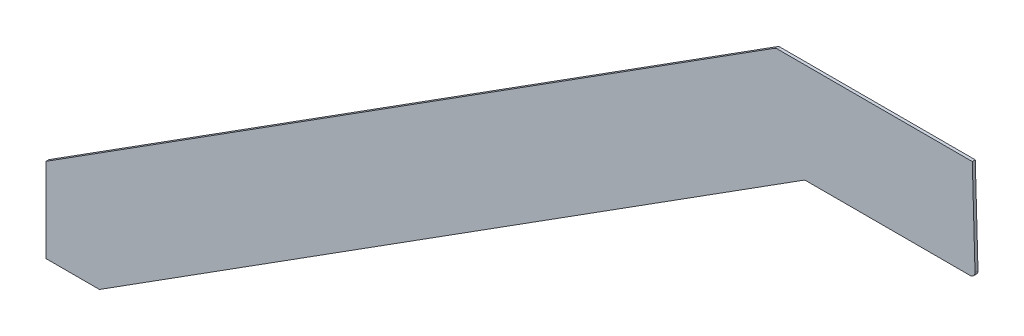
ISO-10303-21;
HEADER;
FILE_DESCRIPTION(('STEP AP214'),'2;1');
FILE_NAME('part.step','',(''),(''),'','','');
FILE_SCHEMA(('AUTOMOTIVE_DESIGN { 1 0 10303 214 1 1 1 1 }'));
ENDSEC;
DATA;
#1=APPLICATION_CONTEXT('core data for automotive mechanical design processes');
#2=APPLICATION_PROTOCOL_DEFINITION('international standard','automotive_design',2000,#1);
#3=PRODUCT_CONTEXT('',#1,'mechanical');
#4=PRODUCT('Part','Part','',(#3));
#5=PRODUCT_RELATED_PRODUCT_CATEGORY('part','',(#4));
#6=PRODUCT_DEFINITION_FORMATION('','',#4);
#7=PRODUCT_DEFINITION_CONTEXT('part definition',#1,'design');
#8=PRODUCT_DEFINITION('design','',#6,#7);
#9=PRODUCT_DEFINITION_SHAPE('','',#8);
#10=(LENGTH_UNIT() NAMED_UNIT(*) SI_UNIT(.MILLI.,.METRE.));
#11=(NAMED_UNIT(*) PLANE_ANGLE_UNIT() SI_UNIT($,.RADIAN.));
#12=(NAMED_UNIT(*) SI_UNIT($,.STERADIAN.) SOLID_ANGLE_UNIT());
#13=UNCERTAINTY_MEASURE_WITH_UNIT(LENGTH_MEASURE(1.E-05),#10,'distance_accuracy_value','');
#14=(GEOMETRIC_REPRESENTATION_CONTEXT(3) GLOBAL_UNCERTAINTY_ASSIGNED_CONTEXT((#13)) GLOBAL_UNIT_ASSIGNED_CONTEXT((#10,
#11,#12)) REPRESENTATION_CONTEXT('',''));
#15=CARTESIAN_POINT('',(0.,0.,0.));
#16=DIRECTION('',(0.,0.,1.));
#17=DIRECTION('',(1.,0.,0.));
#18=AXIS2_PLACEMENT_3D('',#15,#16,#17);
#19=CARTESIAN_POINT('',(-296.68469966244,19.9999999999998,6.));
#20=DIRECTION('',(0.,0.,-1.));
#21=DIRECTION('',(-1.,0.,0.));
#22=AXIS2_PLACEMENT_3D('',#19,#20,#21);
#23=CYLINDRICAL_SURFACE('',#22,10.0000000000001);
#24=CARTESIAN_POINT('',(-296.68469966244,19.9999999999998,0.));
#25=DIRECTION('',(0.,0.,1.));
#26=DIRECTION('',(1.,0.,0.));
#27=AXIS2_PLACEMENT_3D('',#24,#25,#26);
#28=CIRCLE('',#27,10.0000000000001);
#29=CARTESIAN_POINT('',(-296.68469966244,29.9999999999998,0.));
#30=VERTEX_POINT('',#29);
#31=CARTESIAN_POINT('',(-302.04149617051,28.4442128804958,0.));
#32=VERTEX_POINT('',#31);
#33=EDGE_CURVE('E147',#30,#32,#28,.T.);
#34=ORIENTED_EDGE('',*,*,#33,.T.);
#35=DIRECTION('',(0.,0.,-1.));
#36=VECTOR('',#35,1.);
#37=CARTESIAN_POINT('',(-302.04149617051,28.4442128804958,6.));
#38=LINE('',#37,#36);
#39=CARTESIAN_POINT('',(-302.04149617051,28.4442128804958,6.));
#40=VERTEX_POINT('',#39);
#41=EDGE_CURVE('E11',#40,#32,#38,.T.);
#42=ORIENTED_EDGE('',*,*,#41,.F.);
#43=CARTESIAN_POINT('',(-296.68469966244,19.9999999999998,6.));
#44=DIRECTION('',(0.,0.,1.));
#45=DIRECTION('',(1.,0.,0.));
#46=AXIS2_PLACEMENT_3D('',#43,#44,#45);
#47=CIRCLE('',#46,10.0000000000001);
#48=CARTESIAN_POINT('',(-296.68469966244,29.9999999999998,6.));
#49=VERTEX_POINT('',#48);
#50=EDGE_CURVE('E165',#49,#40,#47,.T.);
#51=ORIENTED_EDGE('',*,*,#50,.F.);
#52=DIRECTION('',(0.,0.,-1.));
#53=VECTOR('',#52,1.);
#54=CARTESIAN_POINT('',(-296.68469966244,29.9999999999998,6.));
#55=LINE('',#54,#53);
#56=EDGE_CURVE('E143',#49,#30,#55,.T.);
#57=ORIENTED_EDGE('',*,*,#56,.T.);
#58=EDGE_LOOP('',(#34,#42,#51,#57));
#59=FACE_BOUND('',#58,.T.);
#60=ADVANCED_FACE('F39',(#59),#23,.T.);
#61=CARTESIAN_POINT('',(-1762.45302019176,-898.004168151072,6.));
#62=DIRECTION('',(0.535679650806948,-0.8444212880496,0.));
#63=DIRECTION('',(0.8444212880496,0.535679650806948,0.));
#64=AXIS2_PLACEMENT_3D('',#61,#62,#63);
#65=PLANE('',#64);
#66=DIRECTION('',(-0.8444212880496,-0.535679650806948,0.));
#67=VECTOR('',#66,1.);
#68=CARTESIAN_POINT('',(-1762.45302019176,-898.004168151072,0.));
#69=LINE('',#68,#67);
#70=CARTESIAN_POINT('',(-1762.45302019176,-898.004168151072,0.));
#71=VERTEX_POINT('',#70);
#72=EDGE_CURVE('E150',#32,#71,#69,.T.);
#73=ORIENTED_EDGE('',*,*,#72,.T.);
#74=DIRECTION('',(0.,0.,-1.));
#75=VECTOR('',#74,1.);
#76=CARTESIAN_POINT('',(-1762.45302019176,-898.004168151072,6.));
#77=LINE('',#76,#75);
#78=CARTESIAN_POINT('',(-1762.45302019176,-898.004168151072,6.));
#79=VERTEX_POINT('',#78);
#80=EDGE_CURVE('E47',#79,#71,#77,.T.);
#81=ORIENTED_EDGE('',*,*,#80,.F.);
#82=DIRECTION('',(-0.8444212880496,-0.535679650806948,0.));
#83=VECTOR('',#82,1.);
#84=CARTESIAN_POINT('',(-1762.45302019176,-898.004168151072,6.));
#85=LINE('',#84,#83);
#86=EDGE_CURVE('E104',#40,#79,#85,.T.);
#87=ORIENTED_EDGE('',*,*,#86,.F.);
#88=ORIENTED_EDGE('',*,*,#41,.T.);
#89=EDGE_LOOP('',(#73,#81,#87,#88));
#90=FACE_BOUND('',#89,.T.);
#91=ADVANCED_FACE('F214',(#90),#65,.F.);
#92=CARTESIAN_POINT('',(-1762.45302019176,-898.004168151072,6.));
#93=DIRECTION('',(1.,0.,0.));
#94=DIRECTION('',(0.,0.,-1.));
#95=AXIS2_PLACEMENT_3D('',#92,#93,#94);
#96=PLANE('',#95);
#97=DIRECTION('',(0.,-1.,0.));
#98=VECTOR('',#97,1.);
#99=CARTESIAN_POINT('',(-1762.45302019176,-898.004168151072,0.));
#100=LINE('',#99,#98);
#101=CARTESIAN_POINT('',(-1762.45302019176,-1066.88842576099,0.));
#102=VERTEX_POINT('',#101);
#103=EDGE_CURVE('E152',#71,#102,#100,.T.);
#104=ORIENTED_EDGE('',*,*,#103,.T.);
#105=DIRECTION('',(0.,0.,-1.));
#106=VECTOR('',#105,1.);
#107=CARTESIAN_POINT('',(-1762.45302019176,-1066.88842576099,6.));
#108=LINE('',#107,#106);
#109=CARTESIAN_POINT('',(-1762.45302019176,-1066.88842576099,6.));
#110=VERTEX_POINT('',#109);
#111=EDGE_CURVE('E178',#110,#102,#108,.T.);
#112=ORIENTED_EDGE('',*,*,#111,.F.);
#113=DIRECTION('',(0.,-1.,0.));
#114=VECTOR('',#113,1.);
#115=CARTESIAN_POINT('',(-1762.45302019176,-898.004168151072,6.));
#116=LINE('',#115,#114);
#117=EDGE_CURVE('E186',#79,#110,#116,.T.);
#118=ORIENTED_EDGE('',*,*,#117,.F.);
#119=ORIENTED_EDGE('',*,*,#80,.T.);
#120=EDGE_LOOP('',(#104,#112,#118,#119));
#121=FACE_BOUND('',#120,.T.);
#122=ADVANCED_FACE('F184',(#121),#96,.F.);
#123=CARTESIAN_POINT('',(-1762.45302019176,-1066.88842576099,6.));
#124=DIRECTION('',(0.,1.,0.));
#125=DIRECTION('',(0.,0.,1.));
#126=AXIS2_PLACEMENT_3D('',#123,#124,#125);
#127=PLANE('',#126);
#128=DIRECTION('',(1.,0.,0.));
#129=VECTOR('',#128,1.);
#130=CARTESIAN_POINT('',(-1762.45302019176,-1066.88842576099,0.));
#131=LINE('',#130,#129);
#132=CARTESIAN_POINT('',(-1655.31709003037,-1066.88842576099,0.));
#133=VERTEX_POINT('',#132);
#134=EDGE_CURVE('E154',#102,#133,#131,.T.);
#135=ORIENTED_EDGE('',*,*,#134,.T.);
#136=DIRECTION('',(0.,0.,-1.));
#137=VECTOR('',#136,1.);
#138=CARTESIAN_POINT('',(-1655.31709003037,-1066.88842576099,6.));
#139=LINE('',#138,#137);
#140=CARTESIAN_POINT('',(-1655.31709003037,-1066.88842576099,6.));
#141=VERTEX_POINT('',#140);
#142=EDGE_CURVE('E175',#141,#133,#139,.T.);
#143=ORIENTED_EDGE('',*,*,#142,.F.);
#144=DIRECTION('',(1.,0.,0.));
#145=VECTOR('',#144,1.);
#146=CARTESIAN_POINT('',(-1762.45302019176,-1066.88842576099,6.));
#147=LINE('',#146,#145);
#148=EDGE_CURVE('E204',#110,#141,#147,.T.);
#149=ORIENTED_EDGE('',*,*,#148,.F.);
#150=ORIENTED_EDGE('',*,*,#111,.T.);
#151=EDGE_LOOP('',(#135,#143,#149,#150));
#152=FACE_BOUND('',#151,.T.);
#153=ADVANCED_FACE('F195',(#152),#127,.F.);
#154=CARTESIAN_POINT('',(-1655.31709003037,-1066.88842576099,6.));
#155=DIRECTION('',(-0.535679650806948,0.8444212880496,0.));
#156=DIRECTION('',(-0.8444212880496,-0.535679650806948,0.));
#157=AXIS2_PLACEMENT_3D('',#154,#155,#156);
#158=PLANE('',#157);
#159=DIRECTION('',(0.8444212880496,0.535679650806948,0.));
#160=VECTOR('',#159,1.);
#161=CARTESIAN_POINT('',(-1655.31709003037,-1066.88842576099,0.));
#162=LINE('',#161,#160);
#163=CARTESIAN_POINT('',(-243.955021645657,-171.555787119504,0.));
#164=VERTEX_POINT('',#163);
#165=EDGE_CURVE('E156',#133,#164,#162,.T.);
#166=ORIENTED_EDGE('',*,*,#165,.T.);
#167=DIRECTION('',(0.,0.,-1.));
#168=VECTOR('',#167,1.);
#169=CARTESIAN_POINT('',(-243.955021645657,-171.555787119504,6.));
#170=LINE('',#169,#168);
#171=CARTESIAN_POINT('',(-243.955021645657,-171.555787119504,6.));
#172=VERTEX_POINT('',#171);
#173=EDGE_CURVE('E172',#172,#164,#170,.T.);
#174=ORIENTED_EDGE('',*,*,#173,.F.);
#175=DIRECTION('',(0.8444212880496,0.535679650806948,0.));
#176=VECTOR('',#175,1.);
#177=CARTESIAN_POINT('',(-1655.31709003037,-1066.88842576099,6.));
#178=LINE('',#177,#176);
#179=EDGE_CURVE('E201',#141,#172,#178,.T.);
#180=ORIENTED_EDGE('',*,*,#179,.F.);
#181=ORIENTED_EDGE('',*,*,#142,.T.);
#182=EDGE_LOOP('',(#166,#174,#180,#181));
#183=FACE_BOUND('',#182,.T.);
#184=ADVANCED_FACE('F199',(#183),#158,.F.);
#185=CARTESIAN_POINT('',(-238.598225137587,-180.,6.));
#186=DIRECTION('',(0.,0.,-1.));
#187=DIRECTION('',(-1.,0.,0.));
#188=AXIS2_PLACEMENT_3D('',#185,#186,#187);
#189=CYLINDRICAL_SURFACE('',#188,10.0000000000001);
#190=CARTESIAN_POINT('',(-238.598225137587,-180.,0.));
#191=DIRECTION('',(0.,0.,-1.));
#192=DIRECTION('',(1.,0.,0.));
#193=AXIS2_PLACEMENT_3D('',#190,#191,#192);
#194=CIRCLE('',#193,10.0000000000001);
#195=CARTESIAN_POINT('',(-238.598225137587,-170.,0.));
#196=VERTEX_POINT('',#195);
#197=EDGE_CURVE('E158',#164,#196,#194,.T.);
#198=ORIENTED_EDGE('',*,*,#197,.T.);
#199=DIRECTION('',(0.,0.,-1.));
#200=VECTOR('',#199,1.);
#201=CARTESIAN_POINT('',(-238.598225137587,-170.,6.));
#202=LINE('',#201,#200);
#203=CARTESIAN_POINT('',(-238.598225137587,-170.,6.));
#204=VERTEX_POINT('',#203);
#205=EDGE_CURVE('E169',#204,#196,#202,.T.);
#206=ORIENTED_EDGE('',*,*,#205,.F.);
#207=CARTESIAN_POINT('',(-238.598225137587,-180.,6.));
#208=DIRECTION('',(0.,0.,-1.));
#209=DIRECTION('',(1.,0.,0.));
#210=AXIS2_PLACEMENT_3D('',#207,#208,#209);
#211=CIRCLE('',#210,10.0000000000001);
#212=EDGE_CURVE('E203',#172,#204,#211,.T.);
#213=ORIENTED_EDGE('',*,*,#212,.F.);
#214=ORIENTED_EDGE('',*,*,#173,.T.);
#215=EDGE_LOOP('',(#198,#206,#213,#214));
#216=FACE_BOUND('',#215,.T.);
#217=ADVANCED_FACE('F226',(#216),#189,.F.);
#218=CARTESIAN_POINT('',(-238.598225137587,-170.,6.));
#219=DIRECTION('',(0.,1.,0.));
#220=DIRECTION('',(-1.,0.,0.));
#221=AXIS2_PLACEMENT_3D('',#218,#219,#220);
#222=PLANE('',#221);
#223=DIRECTION('',(1.,0.,0.));
#224=VECTOR('',#223,1.);
#225=CARTESIAN_POINT('',(-238.598225137587,-170.,0.));
#226=LINE('',#225,#224);
#227=CARTESIAN_POINT('',(89.6943801607462,-170.,0.));
#228=VERTEX_POINT('',#227);
#229=EDGE_CURVE('E160',#196,#228,#226,.T.);
#230=ORIENTED_EDGE('',*,*,#229,.T.);
#231=DIRECTION('',(0.,0.,-1.));
#232=VECTOR('',#231,1.);
#233=CARTESIAN_POINT('',(89.6943801607462,-170.,6.));
#234=LINE('',#233,#232);
#235=CARTESIAN_POINT('',(89.6943801607462,-170.,6.));
#236=VERTEX_POINT('',#235);
#237=EDGE_CURVE('E138',#236,#228,#234,.T.);
#238=ORIENTED_EDGE('',*,*,#237,.F.);
#239=DIRECTION('',(1.,0.,0.));
#240=VECTOR('',#239,1.);
#241=CARTESIAN_POINT('',(-238.598225137587,-170.,6.));
#242=LINE('',#241,#240);
#243=EDGE_CURVE('E129',#204,#236,#242,.T.);
#244=ORIENTED_EDGE('',*,*,#243,.F.);
#245=ORIENTED_EDGE('',*,*,#205,.T.);
#246=EDGE_LOOP('',(#230,#238,#244,#245));
#247=FACE_BOUND('',#246,.T.);
#248=ADVANCED_FACE('F229',(#247),#222,.F.);
#249=CARTESIAN_POINT('',(89.6943801607462,-160.,6.));
#250=DIRECTION('',(0.,0.,-1.));
#251=DIRECTION('',(-1.,0.,0.));
#252=AXIS2_PLACEMENT_3D('',#249,#250,#251);
#253=CYLINDRICAL_SURFACE('',#252,10.0000000000001);
#254=CARTESIAN_POINT('',(89.6943801607462,-160.,0.));
#255=DIRECTION('',(0.,0.,1.));
#256=DIRECTION('',(1.,0.,0.));
#257=AXIS2_PLACEMENT_3D('',#254,#255,#256);
#258=CIRCLE('',#257,10.0000000000001);
#259=CARTESIAN_POINT('',(99.6902682512171,-159.713257462548,0.));
#260=VERTEX_POINT('',#259);
#261=EDGE_CURVE('E137',#228,#260,#258,.T.);
#262=ORIENTED_EDGE('',*,*,#261,.T.);
#263=DIRECTION('',(0.,0.,-1.));
#264=VECTOR('',#263,1.);
#265=CARTESIAN_POINT('',(99.6902682512171,-159.713257462548,6.));
#266=LINE('',#265,#264);
#267=CARTESIAN_POINT('',(99.6902682512171,-159.713257462548,6.));
#268=VERTEX_POINT('',#267);
#269=EDGE_CURVE('E134',#268,#260,#266,.T.);
#270=ORIENTED_EDGE('',*,*,#269,.F.);
#271=CARTESIAN_POINT('',(89.6943801607462,-160.,6.));
#272=DIRECTION('',(0.,0.,1.));
#273=DIRECTION('',(1.,0.,0.));
#274=AXIS2_PLACEMENT_3D('',#271,#272,#273);
#275=CIRCLE('',#274,10.0000000000001);
#276=EDGE_CURVE('E123',#236,#268,#275,.T.);
#277=ORIENTED_EDGE('',*,*,#276,.F.);
#278=ORIENTED_EDGE('',*,*,#237,.T.);
#279=EDGE_LOOP('',(#262,#270,#277,#278));
#280=FACE_BOUND('',#279,.T.);
#281=ADVANCED_FACE('F135',(#280),#253,.T.);
#282=CARTESIAN_POINT('',(94.2481444158132,30.,6.));
#283=DIRECTION('',(-0.999588809047077,-0.0286742537452449,0.));
#284=DIRECTION('',(0.0286742537452449,-0.999588809047077,0.));
#285=AXIS2_PLACEMENT_3D('',#282,#283,#284);
#286=PLANE('',#285);
#287=DIRECTION('',(-0.0286742537452449,0.999588809047077,0.));
#288=VECTOR('',#287,1.);
#289=CARTESIAN_POINT('',(94.2481444158132,30.,0.));
#290=LINE('',#289,#288);
#291=CARTESIAN_POINT('',(94.2481444158132,30.,0.));
#292=VERTEX_POINT('',#291);
#293=EDGE_CURVE('E90',#260,#292,#290,.T.);
#294=ORIENTED_EDGE('',*,*,#293,.T.);
#295=DIRECTION('',(0.,0.,-1.));
#296=VECTOR('',#295,1.);
#297=CARTESIAN_POINT('',(94.2481444158132,30.,6.));
#298=LINE('',#297,#296);
#299=CARTESIAN_POINT('',(94.2481444158132,30.,6.));
#300=VERTEX_POINT('',#299);
#301=EDGE_CURVE('E139',#300,#292,#298,.T.);
#302=ORIENTED_EDGE('',*,*,#301,.F.);
#303=DIRECTION('',(-0.0286742537452449,0.999588809047077,0.));
#304=VECTOR('',#303,1.);
#305=CARTESIAN_POINT('',(94.2481444158132,30.,6.));
#306=LINE('',#305,#304);
#307=EDGE_CURVE('E127',#268,#300,#306,.T.);
#308=ORIENTED_EDGE('',*,*,#307,.F.);
#309=ORIENTED_EDGE('',*,*,#269,.T.);
#310=EDGE_LOOP('',(#294,#302,#308,#309));
#311=FACE_BOUND('',#310,.T.);
#312=ADVANCED_FACE('F141',(#311),#286,.F.);
#313=CARTESIAN_POINT('',(-296.68469966244,29.9999999999998,6.));
#314=DIRECTION('',(0.,-1.,0.));
#315=DIRECTION('',(1.,0.,0.));
#316=AXIS2_PLACEMENT_3D('',#313,#314,#315);
#317=PLANE('',#316);
#318=DIRECTION('',(-1.,0.,0.));
#319=VECTOR('',#318,1.);
#320=CARTESIAN_POINT('',(-296.68469966244,29.9999999999998,0.));
#321=LINE('',#320,#319);
#322=EDGE_CURVE('E96',#292,#30,#321,.T.);
#323=ORIENTED_EDGE('',*,*,#322,.T.);
#324=ORIENTED_EDGE('',*,*,#56,.F.);
#325=DIRECTION('',(-1.,0.,0.));
#326=VECTOR('',#325,1.);
#327=CARTESIAN_POINT('',(-296.68469966244,29.9999999999998,6.));
#328=LINE('',#327,#326);
#329=EDGE_CURVE('E55',#300,#49,#328,.T.);
#330=ORIENTED_EDGE('',*,*,#329,.F.);
#331=ORIENTED_EDGE('',*,*,#301,.T.);
#332=EDGE_LOOP('',(#323,#324,#330,#331));
#333=FACE_BOUND('',#332,.T.);
#334=ADVANCED_FACE('F238',(#333),#317,.F.);
#335=CARTESIAN_POINT('',(-296.68469966244,19.9999999999998,6.));
#336=DIRECTION('',(0.,0.,1.));
#337=DIRECTION('',(1.,0.,0.));
#338=AXIS2_PLACEMENT_3D('',#335,#336,#337);
#339=PLANE('',#338);
#340=ORIENTED_EDGE('',*,*,#50,.T.);
#341=ORIENTED_EDGE('',*,*,#86,.T.);
#342=ORIENTED_EDGE('',*,*,#117,.T.);
#343=ORIENTED_EDGE('',*,*,#148,.T.);
#344=ORIENTED_EDGE('',*,*,#179,.T.);
#345=ORIENTED_EDGE('',*,*,#212,.T.);
#346=ORIENTED_EDGE('',*,*,#243,.T.);
#347=ORIENTED_EDGE('',*,*,#276,.T.);
#348=ORIENTED_EDGE('',*,*,#307,.T.);
#349=ORIENTED_EDGE('',*,*,#329,.T.);
#350=EDGE_LOOP('',(#340,#341,#342,#343,#344,#345,#346,#347,#348,#349));
#351=FACE_BOUND('',#350,.T.);
#352=ADVANCED_FACE('F125',(#351),#339,.T.);
#353=CARTESIAN_POINT('',(-296.68469966244,19.9999999999998,0.));
#354=DIRECTION('',(0.,0.,1.));
#355=DIRECTION('',(1.,0.,0.));
#356=AXIS2_PLACEMENT_3D('',#353,#354,#355);
#357=PLANE('',#356);
#358=ORIENTED_EDGE('',*,*,#33,.F.);
#359=ORIENTED_EDGE('',*,*,#322,.F.);
#360=ORIENTED_EDGE('',*,*,#293,.F.);
#361=ORIENTED_EDGE('',*,*,#261,.F.);
#362=ORIENTED_EDGE('',*,*,#229,.F.);
#363=ORIENTED_EDGE('',*,*,#197,.F.);
#364=ORIENTED_EDGE('',*,*,#165,.F.);
#365=ORIENTED_EDGE('',*,*,#134,.F.);
#366=ORIENTED_EDGE('',*,*,#103,.F.);
#367=ORIENTED_EDGE('',*,*,#72,.F.);
#368=EDGE_LOOP('',(#358,#359,#360,#361,#362,#363,#364,#365,#366,#367));
#369=FACE_BOUND('',#368,.T.);
#370=ADVANCED_FACE('F190',(#369),#357,.F.);
#371=CLOSED_SHELL('',(#60,#91,#122,#153,#184,#217,#248,#281,#312,#334,#352,#370));
#372=MANIFOLD_SOLID_BREP('B2',#371);
#373=ADVANCED_BREP_SHAPE_REPRESENTATION('',(#18,#372),#14);
#374=SHAPE_DEFINITION_REPRESENTATION(#9,#373);
ENDSEC;
END-ISO-10303-21;
